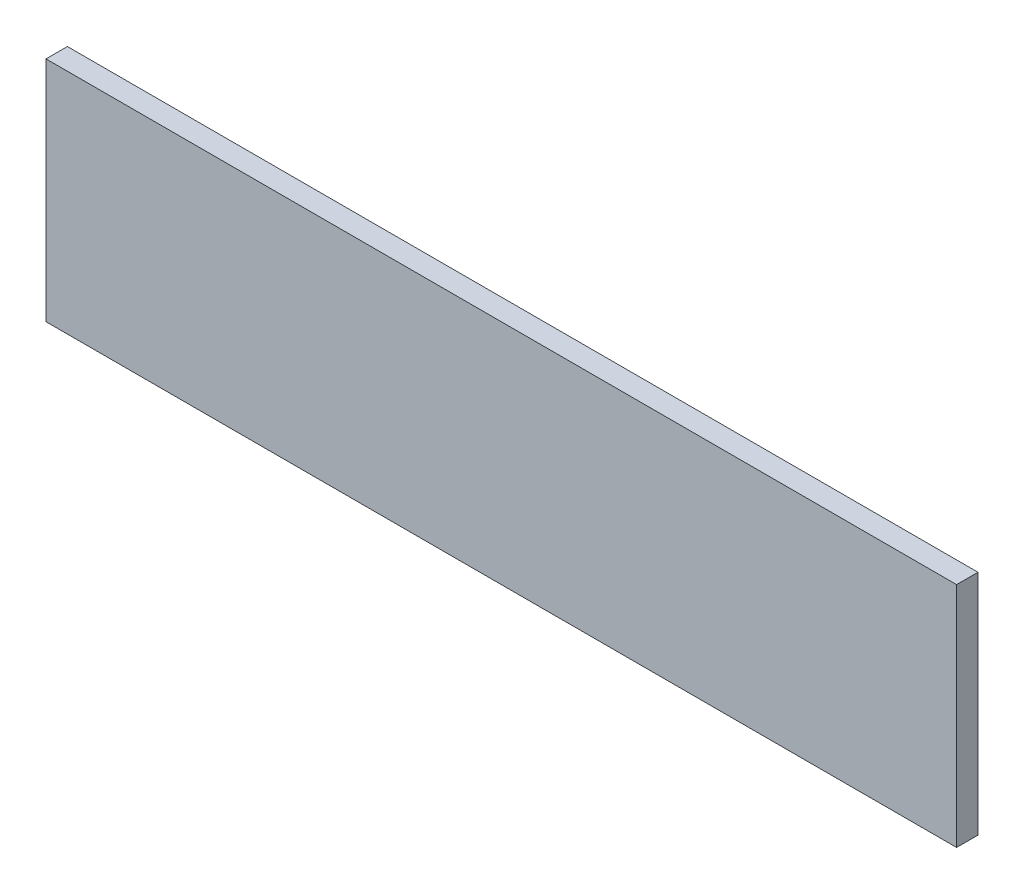
ISO-10303-21;
HEADER;
FILE_DESCRIPTION(('STEP AP214'),'2;1');
FILE_NAME('part.step','',(''),(''),'','','');
FILE_SCHEMA(('AUTOMOTIVE_DESIGN { 1 0 10303 214 1 1 1 1 }'));
ENDSEC;
DATA;
#1=APPLICATION_CONTEXT('core data for automotive mechanical design processes');
#2=APPLICATION_PROTOCOL_DEFINITION('international standard','automotive_design',2000,#1);
#3=PRODUCT_CONTEXT('',#1,'mechanical');
#4=PRODUCT('Part','Part','',(#3));
#5=PRODUCT_RELATED_PRODUCT_CATEGORY('part','',(#4));
#6=PRODUCT_DEFINITION_FORMATION('','',#4);
#7=PRODUCT_DEFINITION_CONTEXT('part definition',#1,'design');
#8=PRODUCT_DEFINITION('design','',#6,#7);
#9=PRODUCT_DEFINITION_SHAPE('','',#8);
#10=(LENGTH_UNIT() NAMED_UNIT(*) SI_UNIT(.MILLI.,.METRE.));
#11=(NAMED_UNIT(*) PLANE_ANGLE_UNIT() SI_UNIT($,.RADIAN.));
#12=(NAMED_UNIT(*) SI_UNIT($,.STERADIAN.) SOLID_ANGLE_UNIT());
#13=UNCERTAINTY_MEASURE_WITH_UNIT(LENGTH_MEASURE(1.E-05),#10,'distance_accuracy_value','');
#14=(GEOMETRIC_REPRESENTATION_CONTEXT(3) GLOBAL_UNCERTAINTY_ASSIGNED_CONTEXT((#13)) GLOBAL_UNIT_ASSIGNED_CONTEXT((#10,
#11,#12)) REPRESENTATION_CONTEXT('',''));
#15=CARTESIAN_POINT('',(0.,0.,0.));
#16=DIRECTION('',(0.,0.,1.));
#17=DIRECTION('',(1.,0.,0.));
#18=AXIS2_PLACEMENT_3D('',#15,#16,#17);
#19=CARTESIAN_POINT('',(254.,-63.5,11.938));
#20=DIRECTION('',(-1.,0.,0.));
#21=DIRECTION('',(0.,0.,1.));
#22=AXIS2_PLACEMENT_3D('',#19,#20,#21);
#23=PLANE('',#22);
#24=DIRECTION('',(0.,1.,0.));
#25=VECTOR('',#24,1.);
#26=CARTESIAN_POINT('',(254.,-63.5,0.));
#27=LINE('',#26,#25);
#28=CARTESIAN_POINT('',(254.,-63.5,0.));
#29=VERTEX_POINT('',#28);
#30=CARTESIAN_POINT('',(254.,63.5,0.));
#31=VERTEX_POINT('',#30);
#32=EDGE_CURVE('E96',#29,#31,#27,.T.);
#33=ORIENTED_EDGE('',*,*,#32,.T.);
#34=DIRECTION('',(0.,0.,-1.));
#35=VECTOR('',#34,1.);
#36=CARTESIAN_POINT('',(254.,63.5,11.938));
#37=LINE('',#36,#35);
#38=CARTESIAN_POINT('',(254.,63.5,11.938));
#39=VERTEX_POINT('',#38);
#40=EDGE_CURVE('E11',#39,#31,#37,.T.);
#41=ORIENTED_EDGE('',*,*,#40,.F.);
#42=DIRECTION('',(0.,1.,0.));
#43=VECTOR('',#42,1.);
#44=CARTESIAN_POINT('',(254.,-63.5,11.938));
#45=LINE('',#44,#43);
#46=CARTESIAN_POINT('',(254.,-63.5,11.938));
#47=VERTEX_POINT('',#46);
#48=EDGE_CURVE('E84',#47,#39,#45,.T.);
#49=ORIENTED_EDGE('',*,*,#48,.F.);
#50=DIRECTION('',(0.,0.,-1.));
#51=VECTOR('',#50,1.);
#52=CARTESIAN_POINT('',(254.,-63.5,11.938));
#53=LINE('',#52,#51);
#54=EDGE_CURVE('E92',#47,#29,#53,.T.);
#55=ORIENTED_EDGE('',*,*,#54,.T.);
#56=EDGE_LOOP('',(#33,#41,#49,#55));
#57=FACE_BOUND('',#56,.T.);
#58=ADVANCED_FACE('F33',(#57),#23,.F.);
#59=CARTESIAN_POINT('',(-254.,63.5,11.938));
#60=DIRECTION('',(0.,-1.,0.));
#61=DIRECTION('',(0.,0.,-1.));
#62=AXIS2_PLACEMENT_3D('',#59,#60,#61);
#63=PLANE('',#62);
#64=DIRECTION('',(-1.,0.,0.));
#65=VECTOR('',#64,1.);
#66=CARTESIAN_POINT('',(-254.,63.5,0.));
#67=LINE('',#66,#65);
#68=CARTESIAN_POINT('',(-254.,63.5,0.));
#69=VERTEX_POINT('',#68);
#70=EDGE_CURVE('E88',#31,#69,#67,.T.);
#71=ORIENTED_EDGE('',*,*,#70,.T.);
#72=DIRECTION('',(0.,0.,-1.));
#73=VECTOR('',#72,1.);
#74=CARTESIAN_POINT('',(-254.,63.5,11.938));
#75=LINE('',#74,#73);
#76=CARTESIAN_POINT('',(-254.,63.5,11.938));
#77=VERTEX_POINT('',#76);
#78=EDGE_CURVE('E41',#77,#69,#75,.T.);
#79=ORIENTED_EDGE('',*,*,#78,.F.);
#80=DIRECTION('',(-1.,0.,0.));
#81=VECTOR('',#80,1.);
#82=CARTESIAN_POINT('',(-254.,63.5,11.938));
#83=LINE('',#82,#81);
#84=EDGE_CURVE('E79',#39,#77,#83,.T.);
#85=ORIENTED_EDGE('',*,*,#84,.F.);
#86=ORIENTED_EDGE('',*,*,#40,.T.);
#87=EDGE_LOOP('',(#71,#79,#85,#86));
#88=FACE_BOUND('',#87,.T.);
#89=ADVANCED_FACE('F87',(#88),#63,.F.);
#90=CARTESIAN_POINT('',(-254.,-63.5,11.938));
#91=DIRECTION('',(1.,0.,0.));
#92=DIRECTION('',(0.,0.,-1.));
#93=AXIS2_PLACEMENT_3D('',#90,#91,#92);
#94=PLANE('',#93);
#95=DIRECTION('',(0.,-1.,0.));
#96=VECTOR('',#95,1.);
#97=CARTESIAN_POINT('',(-254.,-63.5,0.));
#98=LINE('',#97,#96);
#99=CARTESIAN_POINT('',(-254.,-63.5,0.));
#100=VERTEX_POINT('',#99);
#101=EDGE_CURVE('E66',#69,#100,#98,.T.);
#102=ORIENTED_EDGE('',*,*,#101,.T.);
#103=DIRECTION('',(0.,0.,-1.));
#104=VECTOR('',#103,1.);
#105=CARTESIAN_POINT('',(-254.,-63.5,11.938));
#106=LINE('',#105,#104);
#107=CARTESIAN_POINT('',(-254.,-63.5,11.938));
#108=VERTEX_POINT('',#107);
#109=EDGE_CURVE('E89',#108,#100,#106,.T.);
#110=ORIENTED_EDGE('',*,*,#109,.F.);
#111=DIRECTION('',(0.,-1.,0.));
#112=VECTOR('',#111,1.);
#113=CARTESIAN_POINT('',(-254.,-63.5,11.938));
#114=LINE('',#113,#112);
#115=EDGE_CURVE('E82',#77,#108,#114,.T.);
#116=ORIENTED_EDGE('',*,*,#115,.F.);
#117=ORIENTED_EDGE('',*,*,#78,.T.);
#118=EDGE_LOOP('',(#102,#110,#116,#117));
#119=FACE_BOUND('',#118,.T.);
#120=ADVANCED_FACE('F90',(#119),#94,.F.);
#121=CARTESIAN_POINT('',(-254.,-63.5,11.938));
#122=DIRECTION('',(0.,1.,0.));
#123=DIRECTION('',(0.,0.,1.));
#124=AXIS2_PLACEMENT_3D('',#121,#122,#123);
#125=PLANE('',#124);
#126=DIRECTION('',(1.,0.,0.));
#127=VECTOR('',#126,1.);
#128=CARTESIAN_POINT('',(-254.,-63.5,0.));
#129=LINE('',#128,#127);
#130=EDGE_CURVE('E72',#100,#29,#129,.T.);
#131=ORIENTED_EDGE('',*,*,#130,.T.);
#132=ORIENTED_EDGE('',*,*,#54,.F.);
#133=DIRECTION('',(1.,0.,0.));
#134=VECTOR('',#133,1.);
#135=CARTESIAN_POINT('',(-254.,-63.5,11.938));
#136=LINE('',#135,#134);
#137=EDGE_CURVE('E49',#108,#47,#136,.T.);
#138=ORIENTED_EDGE('',*,*,#137,.F.);
#139=ORIENTED_EDGE('',*,*,#109,.T.);
#140=EDGE_LOOP('',(#131,#132,#138,#139));
#141=FACE_BOUND('',#140,.T.);
#142=ADVANCED_FACE('F103',(#141),#125,.F.);
#143=CARTESIAN_POINT('',(0.,0.,11.938));
#144=DIRECTION('',(0.,0.,-1.));
#145=DIRECTION('',(-1.,0.,0.));
#146=AXIS2_PLACEMENT_3D('',#143,#144,#145);
#147=PLANE('',#146);
#148=ORIENTED_EDGE('',*,*,#48,.T.);
#149=ORIENTED_EDGE('',*,*,#84,.T.);
#150=ORIENTED_EDGE('',*,*,#115,.T.);
#151=ORIENTED_EDGE('',*,*,#137,.T.);
#152=EDGE_LOOP('',(#148,#149,#150,#151));
#153=FACE_BOUND('',#152,.T.);
#154=ADVANCED_FACE('F80',(#153),#147,.F.);
#155=CARTESIAN_POINT('',(0.,0.,0.));
#156=DIRECTION('',(0.,0.,-1.));
#157=DIRECTION('',(-1.,0.,0.));
#158=AXIS2_PLACEMENT_3D('',#155,#156,#157);
#159=PLANE('',#158);
#160=ORIENTED_EDGE('',*,*,#32,.F.);
#161=ORIENTED_EDGE('',*,*,#130,.F.);
#162=ORIENTED_EDGE('',*,*,#101,.F.);
#163=ORIENTED_EDGE('',*,*,#70,.F.);
#164=EDGE_LOOP('',(#160,#161,#162,#163));
#165=FACE_BOUND('',#164,.T.);
#166=ADVANCED_FACE('F106',(#165),#159,.T.);
#167=CLOSED_SHELL('',(#58,#89,#120,#142,#154,#166));
#168=MANIFOLD_SOLID_BREP('B2',#167);
#169=ADVANCED_BREP_SHAPE_REPRESENTATION('',(#18,#168),#14);
#170=SHAPE_DEFINITION_REPRESENTATION(#9,#169);
ENDSEC;
END-ISO-10303-21;
